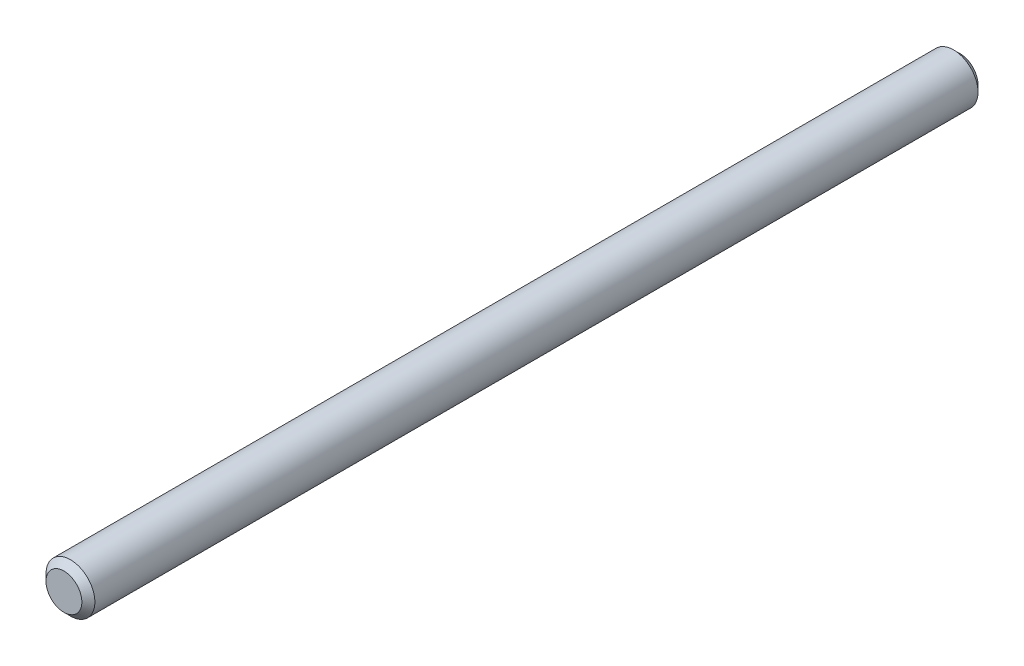
ISO-10303-21;
HEADER;
FILE_DESCRIPTION(('STEP AP214'),'2;1');
FILE_NAME('part.step','',(''),(''),'','','');
FILE_SCHEMA(('AUTOMOTIVE_DESIGN { 1 0 10303 214 1 1 1 1 }'));
ENDSEC;
DATA;
#1=APPLICATION_CONTEXT('core data for automotive mechanical design processes');
#2=APPLICATION_PROTOCOL_DEFINITION('international standard','automotive_design',2000,#1);
#3=PRODUCT_CONTEXT('',#1,'mechanical');
#4=PRODUCT('Part','Part','',(#3));
#5=PRODUCT_RELATED_PRODUCT_CATEGORY('part','',(#4));
#6=PRODUCT_DEFINITION_FORMATION('','',#4);
#7=PRODUCT_DEFINITION_CONTEXT('part definition',#1,'design');
#8=PRODUCT_DEFINITION('design','',#6,#7);
#9=PRODUCT_DEFINITION_SHAPE('','',#8);
#10=(LENGTH_UNIT() NAMED_UNIT(*) SI_UNIT(.MILLI.,.METRE.));
#11=(NAMED_UNIT(*) PLANE_ANGLE_UNIT() SI_UNIT($,.RADIAN.));
#12=(NAMED_UNIT(*) SI_UNIT($,.STERADIAN.) SOLID_ANGLE_UNIT());
#13=UNCERTAINTY_MEASURE_WITH_UNIT(LENGTH_MEASURE(1.E-05),#10,'distance_accuracy_value','');
#14=(GEOMETRIC_REPRESENTATION_CONTEXT(3) GLOBAL_UNCERTAINTY_ASSIGNED_CONTEXT((#13)) GLOBAL_UNIT_ASSIGNED_CONTEXT((#10,
#11,#12)) REPRESENTATION_CONTEXT('',''));
#15=CARTESIAN_POINT('',(0.,0.,0.));
#16=DIRECTION('',(0.,0.,1.));
#17=DIRECTION('',(1.,0.,0.));
#18=AXIS2_PLACEMENT_3D('',#15,#16,#17);
#19=CARTESIAN_POINT('',(0.,0.,137.5));
#20=DIRECTION('',(0.,0.,-1.));
#21=DIRECTION('',(-1.,0.,0.));
#22=AXIS2_PLACEMENT_3D('',#19,#20,#21);
#23=CYLINDRICAL_SURFACE('',#22,7.5);
#24=CARTESIAN_POINT('',(0.,0.,135.5));
#25=DIRECTION('',(0.,0.,1.));
#26=DIRECTION('',(1.,0.,0.));
#27=AXIS2_PLACEMENT_3D('',#24,#25,#26);
#28=CIRCLE('',#27,7.5);
#29=CARTESIAN_POINT('',(7.5,0.,135.5));
#30=VERTEX_POINT('',#29);
#31=EDGE_CURVE('E37',#30,#30,#28,.F.);
#32=ORIENTED_EDGE('',*,*,#31,.T.);
#33=EDGE_LOOP('',(#32));
#34=FACE_BOUND('',#33,.T.);
#35=CARTESIAN_POINT('',(0.,0.,-135.5));
#36=DIRECTION('',(0.,0.,1.));
#37=DIRECTION('',(1.,0.,0.));
#38=AXIS2_PLACEMENT_3D('',#35,#36,#37);
#39=CIRCLE('',#38,7.5);
#40=CARTESIAN_POINT('',(7.5,0.,-135.5));
#41=VERTEX_POINT('',#40);
#42=EDGE_CURVE('E41',#41,#41,#39,.T.);
#43=ORIENTED_EDGE('',*,*,#42,.T.);
#44=EDGE_LOOP('',(#43));
#45=FACE_BOUND('',#44,.T.);
#46=ADVANCED_FACE('F30',(#34,#45),#23,.T.);
#47=CARTESIAN_POINT('',(0.,0.,137.5));
#48=DIRECTION('',(0.,0.,1.));
#49=DIRECTION('',(1.,0.,0.));
#50=AXIS2_PLACEMENT_3D('',#47,#48,#49);
#51=PLANE('',#50);
#52=CARTESIAN_POINT('',(0.,0.,137.5));
#53=DIRECTION('',(0.,0.,1.));
#54=DIRECTION('',(1.,0.,0.));
#55=AXIS2_PLACEMENT_3D('',#52,#53,#54);
#56=CIRCLE('',#55,5.50000000000006);
#57=CARTESIAN_POINT('',(5.50000000000006,0.,137.5));
#58=VERTEX_POINT('',#57);
#59=EDGE_CURVE('E45',#58,#58,#56,.T.);
#60=ORIENTED_EDGE('',*,*,#59,.T.);
#61=EDGE_LOOP('',(#60));
#62=FACE_BOUND('',#61,.T.);
#63=ADVANCED_FACE('F51',(#62),#51,.T.);
#64=CARTESIAN_POINT('',(0.,0.,-137.5));
#65=DIRECTION('',(0.,0.,1.));
#66=DIRECTION('',(1.,0.,0.));
#67=AXIS2_PLACEMENT_3D('',#64,#65,#66);
#68=PLANE('',#67);
#69=CARTESIAN_POINT('',(0.,0.,-137.5));
#70=DIRECTION('',(0.,0.,1.));
#71=DIRECTION('',(1.,0.,0.));
#72=AXIS2_PLACEMENT_3D('',#69,#70,#71);
#73=CIRCLE('',#72,5.5);
#74=CARTESIAN_POINT('',(5.5,0.,-137.5));
#75=VERTEX_POINT('',#74);
#76=EDGE_CURVE('E10',#75,#75,#73,.F.);
#77=ORIENTED_EDGE('',*,*,#76,.T.);
#78=EDGE_LOOP('',(#77));
#79=FACE_BOUND('',#78,.T.);
#80=ADVANCED_FACE('F55',(#79),#68,.F.);
#81=CARTESIAN_POINT('',(0.,0.,137.5));
#82=DIRECTION('',(0.,0.,-1.));
#83=DIRECTION('',(-1.,0.,0.));
#84=AXIS2_PLACEMENT_3D('',#81,#82,#83);
#85=CONICAL_SURFACE('',#84,5.50000000000006,0.785398163397447);
#86=ORIENTED_EDGE('',*,*,#31,.F.);
#87=EDGE_LOOP('',(#86));
#88=FACE_BOUND('',#87,.T.);
#89=ORIENTED_EDGE('',*,*,#59,.F.);
#90=EDGE_LOOP('',(#89));
#91=FACE_BOUND('',#90,.T.);
#92=ADVANCED_FACE('F53',(#88,#91),#85,.T.);
#93=CARTESIAN_POINT('',(0.,0.,-135.5));
#94=DIRECTION('',(0.,0.,1.));
#95=DIRECTION('',(1.,0.,0.));
#96=AXIS2_PLACEMENT_3D('',#93,#94,#95);
#97=CONICAL_SURFACE('',#96,7.5,0.785398163397447);
#98=ORIENTED_EDGE('',*,*,#76,.F.);
#99=EDGE_LOOP('',(#98));
#100=FACE_BOUND('',#99,.T.);
#101=ORIENTED_EDGE('',*,*,#42,.F.);
#102=EDGE_LOOP('',(#101));
#103=FACE_BOUND('',#102,.T.);
#104=ADVANCED_FACE('F32',(#100,#103),#97,.T.);
#105=CLOSED_SHELL('',(#46,#63,#80,#92,#104));
#106=MANIFOLD_SOLID_BREP('B2',#105);
#107=ADVANCED_BREP_SHAPE_REPRESENTATION('',(#18,#106),#14);
#108=SHAPE_DEFINITION_REPRESENTATION(#9,#107);
ENDSEC;
END-ISO-10303-21;
